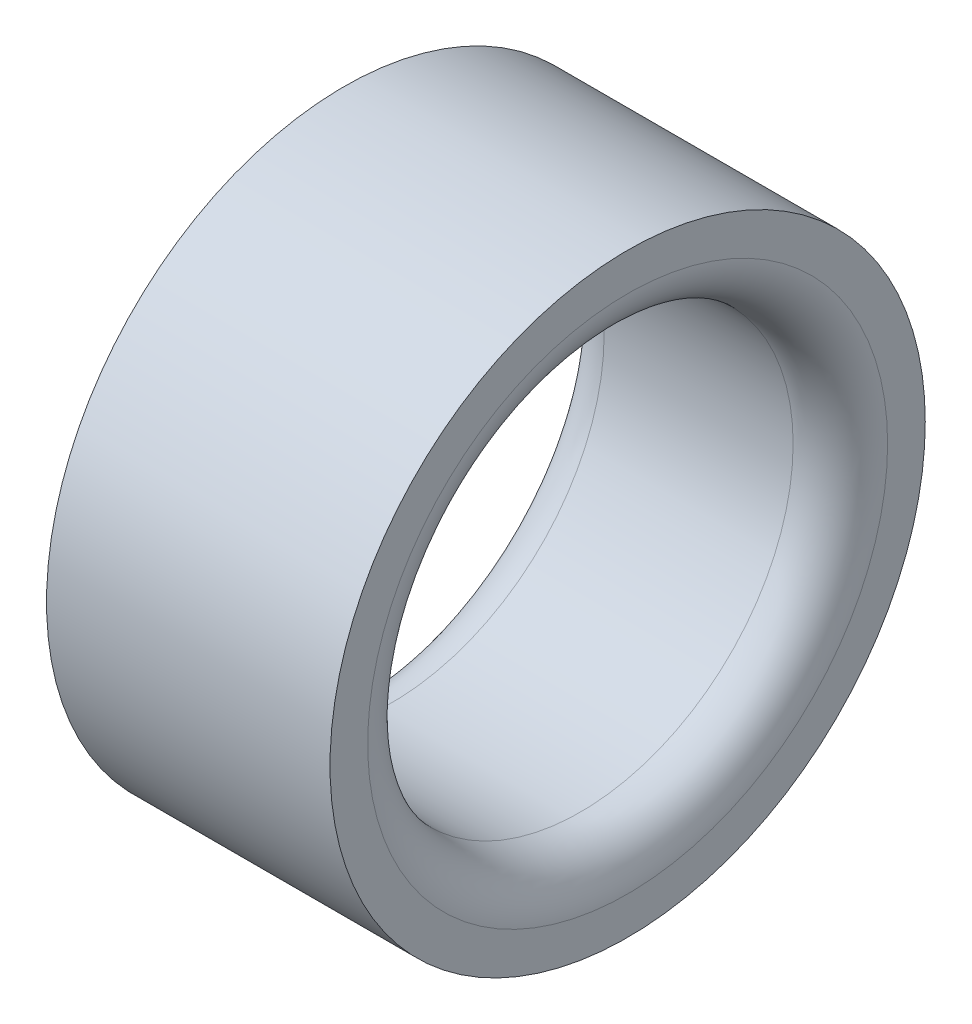
ISO-10303-21;
HEADER;
FILE_DESCRIPTION(('STEP AP214'),'2;1');
FILE_NAME('part.step','',(''),(''),'','','');
FILE_SCHEMA(('AUTOMOTIVE_DESIGN { 1 0 10303 214 1 1 1 1 }'));
ENDSEC;
DATA;
#1=APPLICATION_CONTEXT('core data for automotive mechanical design processes');
#2=APPLICATION_PROTOCOL_DEFINITION('international standard','automotive_design',2000,#1);
#3=PRODUCT_CONTEXT('',#1,'mechanical');
#4=PRODUCT('Part','Part','',(#3));
#5=PRODUCT_RELATED_PRODUCT_CATEGORY('part','',(#4));
#6=PRODUCT_DEFINITION_FORMATION('','',#4);
#7=PRODUCT_DEFINITION_CONTEXT('part definition',#1,'design');
#8=PRODUCT_DEFINITION('design','',#6,#7);
#9=PRODUCT_DEFINITION_SHAPE('','',#8);
#10=(LENGTH_UNIT() NAMED_UNIT(*) SI_UNIT(.MILLI.,.METRE.));
#11=(NAMED_UNIT(*) PLANE_ANGLE_UNIT() SI_UNIT($,.RADIAN.));
#12=(NAMED_UNIT(*) SI_UNIT($,.STERADIAN.) SOLID_ANGLE_UNIT());
#13=UNCERTAINTY_MEASURE_WITH_UNIT(LENGTH_MEASURE(1.E-05),#10,'distance_accuracy_value','');
#14=(GEOMETRIC_REPRESENTATION_CONTEXT(3) GLOBAL_UNCERTAINTY_ASSIGNED_CONTEXT((#13)) GLOBAL_UNIT_ASSIGNED_CONTEXT((#10,
#11,#12)) REPRESENTATION_CONTEXT('',''));
#15=CARTESIAN_POINT('',(0.,0.,0.));
#16=DIRECTION('',(0.,0.,1.));
#17=DIRECTION('',(1.,0.,0.));
#18=AXIS2_PLACEMENT_3D('',#15,#16,#17);
#19=CARTESIAN_POINT('',(19.05,0.,0.));
#20=DIRECTION('',(1.,0.,0.));
#21=DIRECTION('',(0.,0.,-1.));
#22=AXIS2_PLACEMENT_3D('',#19,#20,#21);
#23=PLANE('',#22);
#24=CARTESIAN_POINT('',(19.05,0.,0.));
#25=DIRECTION('',(1.,0.,0.));
#26=DIRECTION('',(0.,0.,-1.));
#27=AXIS2_PLACEMENT_3D('',#24,#25,#26);
#28=CIRCLE('',#27,17.469919975);
#29=CARTESIAN_POINT('',(19.05,0.,-17.469919975));
#30=VERTEX_POINT('',#29);
#31=EDGE_CURVE('E10',#30,#30,#28,.F.);
#32=ORIENTED_EDGE('',*,*,#31,.T.);
#33=EDGE_LOOP('',(#32));
#34=FACE_BOUND('',#33,.T.);
#35=CARTESIAN_POINT('',(19.05,0.,0.));
#36=DIRECTION('',(1.,0.,0.));
#37=DIRECTION('',(0.,0.,-1.));
#38=AXIS2_PLACEMENT_3D('',#35,#36,#37);
#39=CIRCLE('',#38,20.);
#40=CARTESIAN_POINT('',(19.05,0.,-20.));
#41=VERTEX_POINT('',#40);
#42=EDGE_CURVE('E52',#41,#41,#39,.T.);
#43=ORIENTED_EDGE('',*,*,#42,.T.);
#44=EDGE_LOOP('',(#43));
#45=FACE_BOUND('',#44,.T.);
#46=ADVANCED_FACE('F32',(#34,#45),#23,.T.);
#47=CARTESIAN_POINT('',(0.,0.,0.));
#48=DIRECTION('',(1.,0.,0.));
#49=DIRECTION('',(0.,0.,-1.));
#50=AXIS2_PLACEMENT_3D('',#47,#48,#49);
#51=PLANE('',#50);
#52=CARTESIAN_POINT('',(0.,0.,0.));
#53=DIRECTION('',(1.,0.,0.));
#54=DIRECTION('',(0.,0.,-1.));
#55=AXIS2_PLACEMENT_3D('',#52,#53,#54);
#56=CIRCLE('',#55,17.469919975);
#57=CARTESIAN_POINT('',(0.,0.,-17.469919975));
#58=VERTEX_POINT('',#57);
#59=EDGE_CURVE('E47',#58,#58,#56,.T.);
#60=ORIENTED_EDGE('',*,*,#59,.T.);
#61=EDGE_LOOP('',(#60));
#62=FACE_BOUND('',#61,.T.);
#63=CARTESIAN_POINT('',(0.,0.,0.));
#64=DIRECTION('',(1.,0.,0.));
#65=DIRECTION('',(0.,0.,-1.));
#66=AXIS2_PLACEMENT_3D('',#63,#64,#65);
#67=CIRCLE('',#66,20.);
#68=CARTESIAN_POINT('',(0.,0.,-20.));
#69=VERTEX_POINT('',#68);
#70=EDGE_CURVE('E53',#69,#69,#67,.T.);
#71=ORIENTED_EDGE('',*,*,#70,.F.);
#72=EDGE_LOOP('',(#71));
#73=FACE_BOUND('',#72,.T.);
#74=ADVANCED_FACE('F64',(#62,#73),#51,.F.);
#75=CARTESIAN_POINT('',(19.05,0.,0.));
#76=DIRECTION('',(-1.,0.,0.));
#77=DIRECTION('',(0.,0.,1.));
#78=AXIS2_PLACEMENT_3D('',#75,#76,#77);
#79=CYLINDRICAL_SURFACE('',#78,20.);
#80=ORIENTED_EDGE('',*,*,#42,.F.);
#81=EDGE_LOOP('',(#80));
#82=FACE_BOUND('',#81,.T.);
#83=ORIENTED_EDGE('',*,*,#70,.T.);
#84=EDGE_LOOP('',(#83));
#85=FACE_BOUND('',#84,.T.);
#86=ADVANCED_FACE('F60',(#82,#85),#79,.T.);
#87=CARTESIAN_POINT('',(19.05,0.,0.));
#88=DIRECTION('',(-1.,0.,0.));
#89=DIRECTION('',(0.,0.,1.));
#90=AXIS2_PLACEMENT_3D('',#87,#88,#89);
#91=CYLINDRICAL_SURFACE('',#90,14.294919975);
#92=CARTESIAN_POINT('',(3.175,0.,0.));
#93=DIRECTION('',(1.,0.,0.));
#94=DIRECTION('',(0.,0.,-1.));
#95=AXIS2_PLACEMENT_3D('',#92,#93,#94);
#96=CIRCLE('',#95,14.294919975);
#97=CARTESIAN_POINT('',(3.175,0.,-14.294919975));
#98=VERTEX_POINT('',#97);
#99=EDGE_CURVE('E39',#98,#98,#96,.F.);
#100=ORIENTED_EDGE('',*,*,#99,.T.);
#101=EDGE_LOOP('',(#100));
#102=FACE_BOUND('',#101,.T.);
#103=CARTESIAN_POINT('',(15.875,0.,0.));
#104=DIRECTION('',(1.,0.,0.));
#105=DIRECTION('',(0.,0.,-1.));
#106=AXIS2_PLACEMENT_3D('',#103,#104,#105);
#107=CIRCLE('',#106,14.294919975);
#108=CARTESIAN_POINT('',(15.875,0.,-14.294919975));
#109=VERTEX_POINT('',#108);
#110=EDGE_CURVE('E43',#109,#109,#107,.T.);
#111=ORIENTED_EDGE('',*,*,#110,.T.);
#112=EDGE_LOOP('',(#111));
#113=FACE_BOUND('',#112,.T.);
#114=ADVANCED_FACE('F63',(#102,#113),#91,.F.);
#115=CARTESIAN_POINT('',(3.175,0.,0.));
#116=DIRECTION('',(1.,0.,0.));
#117=DIRECTION('',(0.,0.,-1.));
#118=AXIS2_PLACEMENT_3D('',#115,#116,#117);
#119=TOROIDAL_SURFACE('',#118,17.469919975,3.175);
#120=ORIENTED_EDGE('',*,*,#99,.F.);
#121=EDGE_LOOP('',(#120));
#122=FACE_BOUND('',#121,.T.);
#123=ORIENTED_EDGE('',*,*,#59,.F.);
#124=EDGE_LOOP('',(#123));
#125=FACE_BOUND('',#124,.T.);
#126=ADVANCED_FACE('F76',(#122,#125),#119,.T.);
#127=CARTESIAN_POINT('',(15.875,0.,0.));
#128=DIRECTION('',(1.,0.,0.));
#129=DIRECTION('',(0.,0.,-1.));
#130=AXIS2_PLACEMENT_3D('',#127,#128,#129);
#131=TOROIDAL_SURFACE('',#130,17.469919975,3.175);
#132=ORIENTED_EDGE('',*,*,#31,.F.);
#133=EDGE_LOOP('',(#132));
#134=FACE_BOUND('',#133,.T.);
#135=ORIENTED_EDGE('',*,*,#110,.F.);
#136=EDGE_LOOP('',(#135));
#137=FACE_BOUND('',#136,.T.);
#138=ADVANCED_FACE('F34',(#134,#137),#131,.T.);
#139=CLOSED_SHELL('',(#46,#74,#86,#114,#126,#138));
#140=MANIFOLD_SOLID_BREP('B2',#139);
#141=ADVANCED_BREP_SHAPE_REPRESENTATION('',(#18,#140),#14);
#142=SHAPE_DEFINITION_REPRESENTATION(#9,#141);
ENDSEC;
END-ISO-10303-21;
